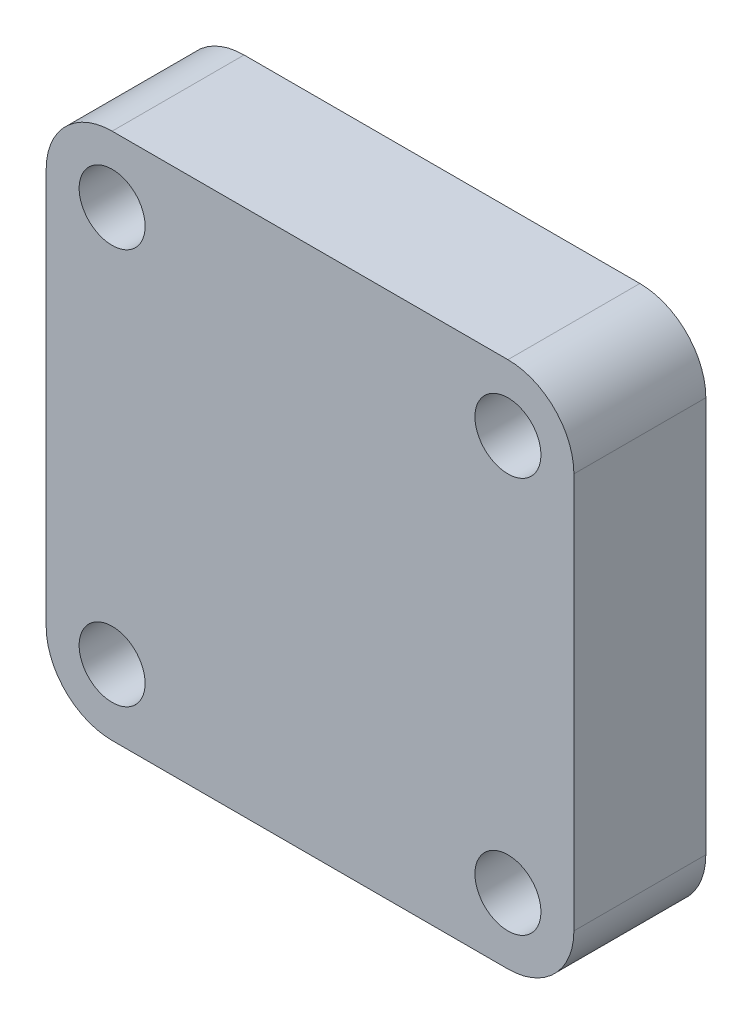
ISO-10303-21;
HEADER;
FILE_DESCRIPTION(('STEP AP214'),'2;1');
FILE_NAME('part.step','',(''),(''),'','','');
FILE_SCHEMA(('AUTOMOTIVE_DESIGN { 1 0 10303 214 1 1 1 1 }'));
ENDSEC;
DATA;
#1=APPLICATION_CONTEXT('core data for automotive mechanical design processes');
#2=APPLICATION_PROTOCOL_DEFINITION('international standard','automotive_design',2000,#1);
#3=PRODUCT_CONTEXT('',#1,'mechanical');
#4=PRODUCT('Part','Part','',(#3));
#5=PRODUCT_RELATED_PRODUCT_CATEGORY('part','',(#4));
#6=PRODUCT_DEFINITION_FORMATION('','',#4);
#7=PRODUCT_DEFINITION_CONTEXT('part definition',#1,'design');
#8=PRODUCT_DEFINITION('design','',#6,#7);
#9=PRODUCT_DEFINITION_SHAPE('','',#8);
#10=(LENGTH_UNIT() NAMED_UNIT(*) SI_UNIT(.MILLI.,.METRE.));
#11=(NAMED_UNIT(*) PLANE_ANGLE_UNIT() SI_UNIT($,.RADIAN.));
#12=(NAMED_UNIT(*) SI_UNIT($,.STERADIAN.) SOLID_ANGLE_UNIT());
#13=UNCERTAINTY_MEASURE_WITH_UNIT(LENGTH_MEASURE(1.E-05),#10,'distance_accuracy_value','');
#14=(GEOMETRIC_REPRESENTATION_CONTEXT(3) GLOBAL_UNCERTAINTY_ASSIGNED_CONTEXT((#13)) GLOBAL_UNIT_ASSIGNED_CONTEXT((#10,
#11,#12)) REPRESENTATION_CONTEXT('',''));
#15=CARTESIAN_POINT('',(0.,0.,0.));
#16=DIRECTION('',(0.,0.,1.));
#17=DIRECTION('',(1.,0.,0.));
#18=AXIS2_PLACEMENT_3D('',#15,#16,#17);
#19=CARTESIAN_POINT('',(0.,0.,10.));
#20=DIRECTION('',(1.,0.,0.));
#21=DIRECTION('',(0.,0.,-1.));
#22=AXIS2_PLACEMENT_3D('',#19,#20,#21);
#23=PLANE('',#22);
#24=DIRECTION('',(0.,-1.,0.));
#25=VECTOR('',#24,1.);
#26=CARTESIAN_POINT('',(0.,0.,0.));
#27=LINE('',#26,#25);
#28=CARTESIAN_POINT('',(0.,35.,0.));
#29=VERTEX_POINT('',#28);
#30=CARTESIAN_POINT('',(0.,5.,0.));
#31=VERTEX_POINT('',#30);
#32=EDGE_CURVE('E160',#29,#31,#27,.T.);
#33=ORIENTED_EDGE('',*,*,#32,.T.);
#34=DIRECTION('',(0.,0.,-1.));
#35=VECTOR('',#34,1.);
#36=CARTESIAN_POINT('',(0.,5.,10.));
#37=LINE('',#36,#35);
#38=CARTESIAN_POINT('',(0.,5.,10.));
#39=VERTEX_POINT('',#38);
#40=EDGE_CURVE('E11',#31,#39,#37,.F.);
#41=ORIENTED_EDGE('',*,*,#40,.T.);
#42=DIRECTION('',(0.,-1.,0.));
#43=VECTOR('',#42,1.);
#44=CARTESIAN_POINT('',(0.,0.,10.));
#45=LINE('',#44,#43);
#46=CARTESIAN_POINT('',(0.,35.,10.));
#47=VERTEX_POINT('',#46);
#48=EDGE_CURVE('E128',#47,#39,#45,.T.);
#49=ORIENTED_EDGE('',*,*,#48,.F.);
#50=DIRECTION('',(0.,0.,-1.));
#51=VECTOR('',#50,1.);
#52=CARTESIAN_POINT('',(0.,35.,10.));
#53=LINE('',#52,#51);
#54=EDGE_CURVE('E44',#47,#29,#53,.T.);
#55=ORIENTED_EDGE('',*,*,#54,.T.);
#56=EDGE_LOOP('',(#33,#41,#49,#55));
#57=FACE_BOUND('',#56,.T.);
#58=ADVANCED_FACE('F36',(#57),#23,.F.);
#59=CARTESIAN_POINT('',(0.,0.,10.));
#60=DIRECTION('',(0.,1.,0.));
#61=DIRECTION('',(0.,0.,1.));
#62=AXIS2_PLACEMENT_3D('',#59,#60,#61);
#63=PLANE('',#62);
#64=DIRECTION('',(1.,0.,0.));
#65=VECTOR('',#64,1.);
#66=CARTESIAN_POINT('',(0.,0.,0.));
#67=LINE('',#66,#65);
#68=CARTESIAN_POINT('',(5.,0.,0.));
#69=VERTEX_POINT('',#68);
#70=CARTESIAN_POINT('',(35.,0.,0.));
#71=VERTEX_POINT('',#70);
#72=EDGE_CURVE('E133',#69,#71,#67,.T.);
#73=ORIENTED_EDGE('',*,*,#72,.T.);
#74=DIRECTION('',(0.,0.,-1.));
#75=VECTOR('',#74,1.);
#76=CARTESIAN_POINT('',(35.,0.,10.));
#77=LINE('',#76,#75);
#78=CARTESIAN_POINT('',(35.,0.,10.));
#79=VERTEX_POINT('',#78);
#80=EDGE_CURVE('E51',#71,#79,#77,.F.);
#81=ORIENTED_EDGE('',*,*,#80,.T.);
#82=DIRECTION('',(1.,0.,0.));
#83=VECTOR('',#82,1.);
#84=CARTESIAN_POINT('',(0.,0.,10.));
#85=LINE('',#84,#83);
#86=CARTESIAN_POINT('',(5.,0.,10.));
#87=VERTEX_POINT('',#86);
#88=EDGE_CURVE('E131',#87,#79,#85,.T.);
#89=ORIENTED_EDGE('',*,*,#88,.F.);
#90=DIRECTION('',(0.,0.,-1.));
#91=VECTOR('',#90,1.);
#92=CARTESIAN_POINT('',(5.,0.,10.));
#93=LINE('',#92,#91);
#94=EDGE_CURVE('E152',#87,#69,#93,.T.);
#95=ORIENTED_EDGE('',*,*,#94,.T.);
#96=EDGE_LOOP('',(#73,#81,#89,#95));
#97=FACE_BOUND('',#96,.T.);
#98=ADVANCED_FACE('F222',(#97),#63,.F.);
#99=CARTESIAN_POINT('',(40.,0.,10.));
#100=DIRECTION('',(-1.,0.,0.));
#101=DIRECTION('',(0.,0.,1.));
#102=AXIS2_PLACEMENT_3D('',#99,#100,#101);
#103=PLANE('',#102);
#104=DIRECTION('',(0.,1.,0.));
#105=VECTOR('',#104,1.);
#106=CARTESIAN_POINT('',(40.,0.,0.));
#107=LINE('',#106,#105);
#108=CARTESIAN_POINT('',(40.,5.,0.));
#109=VERTEX_POINT('',#108);
#110=CARTESIAN_POINT('',(40.,35.,0.));
#111=VERTEX_POINT('',#110);
#112=EDGE_CURVE('E129',#109,#111,#107,.T.);
#113=ORIENTED_EDGE('',*,*,#112,.T.);
#114=DIRECTION('',(0.,0.,-1.));
#115=VECTOR('',#114,1.);
#116=CARTESIAN_POINT('',(40.,35.,10.));
#117=LINE('',#116,#115);
#118=CARTESIAN_POINT('',(40.,35.,10.));
#119=VERTEX_POINT('',#118);
#120=EDGE_CURVE('E107',#111,#119,#117,.F.);
#121=ORIENTED_EDGE('',*,*,#120,.T.);
#122=DIRECTION('',(0.,1.,0.));
#123=VECTOR('',#122,1.);
#124=CARTESIAN_POINT('',(40.,0.,10.));
#125=LINE('',#124,#123);
#126=CARTESIAN_POINT('',(40.,5.,10.));
#127=VERTEX_POINT('',#126);
#128=EDGE_CURVE('E172',#127,#119,#125,.T.);
#129=ORIENTED_EDGE('',*,*,#128,.F.);
#130=DIRECTION('',(0.,0.,-1.));
#131=VECTOR('',#130,1.);
#132=CARTESIAN_POINT('',(40.,5.,10.));
#133=LINE('',#132,#131);
#134=EDGE_CURVE('E112',#127,#109,#133,.T.);
#135=ORIENTED_EDGE('',*,*,#134,.T.);
#136=EDGE_LOOP('',(#113,#121,#129,#135));
#137=FACE_BOUND('',#136,.T.);
#138=ADVANCED_FACE('F219',(#137),#103,.F.);
#139=CARTESIAN_POINT('',(0.,40.,10.));
#140=DIRECTION('',(0.,-1.,0.));
#141=DIRECTION('',(0.,0.,-1.));
#142=AXIS2_PLACEMENT_3D('',#139,#140,#141);
#143=PLANE('',#142);
#144=DIRECTION('',(-1.,0.,0.));
#145=VECTOR('',#144,1.);
#146=CARTESIAN_POINT('',(0.,40.,10.));
#147=LINE('',#146,#145);
#148=CARTESIAN_POINT('',(35.,40.,10.));
#149=VERTEX_POINT('',#148);
#150=CARTESIAN_POINT('',(5.,40.,10.));
#151=VERTEX_POINT('',#150);
#152=EDGE_CURVE('E122',#149,#151,#147,.T.);
#153=ORIENTED_EDGE('',*,*,#152,.F.);
#154=DIRECTION('',(0.,0.,-1.));
#155=VECTOR('',#154,1.);
#156=CARTESIAN_POINT('',(35.,40.,10.));
#157=LINE('',#156,#155);
#158=CARTESIAN_POINT('',(35.,40.,0.));
#159=VERTEX_POINT('',#158);
#160=EDGE_CURVE('E106',#149,#159,#157,.T.);
#161=ORIENTED_EDGE('',*,*,#160,.T.);
#162=DIRECTION('',(-1.,0.,0.));
#163=VECTOR('',#162,1.);
#164=CARTESIAN_POINT('',(0.,40.,0.));
#165=LINE('',#164,#163);
#166=CARTESIAN_POINT('',(5.,40.,0.));
#167=VERTEX_POINT('',#166);
#168=EDGE_CURVE('E119',#159,#167,#165,.T.);
#169=ORIENTED_EDGE('',*,*,#168,.T.);
#170=DIRECTION('',(0.,0.,-1.));
#171=VECTOR('',#170,1.);
#172=CARTESIAN_POINT('',(5.,40.,10.));
#173=LINE('',#172,#171);
#174=EDGE_CURVE('E124',#167,#151,#173,.F.);
#175=ORIENTED_EDGE('',*,*,#174,.T.);
#176=EDGE_LOOP('',(#153,#161,#169,#175));
#177=FACE_BOUND('',#176,.T.);
#178=ADVANCED_FACE('F118',(#177),#143,.F.);
#179=CARTESIAN_POINT('',(0.,0.,10.));
#180=DIRECTION('',(0.,0.,-1.));
#181=DIRECTION('',(-1.,0.,0.));
#182=AXIS2_PLACEMENT_3D('',#179,#180,#181);
#183=PLANE('',#182);
#184=CARTESIAN_POINT('',(35.,5.,10.));
#185=DIRECTION('',(0.,0.,1.));
#186=DIRECTION('',(-1.,0.,0.));
#187=AXIS2_PLACEMENT_3D('',#184,#185,#186);
#188=CIRCLE('',#187,2.5);
#189=CARTESIAN_POINT('',(32.5,5.,10.));
#190=VERTEX_POINT('',#189);
#191=EDGE_CURVE('E191',#190,#190,#188,.T.);
#192=ORIENTED_EDGE('',*,*,#191,.F.);
#193=EDGE_LOOP('',(#192));
#194=FACE_BOUND('',#193,.T.);
#195=CARTESIAN_POINT('',(35.,35.,10.));
#196=DIRECTION('',(0.,0.,-1.));
#197=DIRECTION('',(-1.,0.,0.));
#198=AXIS2_PLACEMENT_3D('',#195,#196,#197);
#199=CIRCLE('',#198,2.5);
#200=CARTESIAN_POINT('',(32.5,35.,10.));
#201=VERTEX_POINT('',#200);
#202=EDGE_CURVE('E185',#201,#201,#199,.T.);
#203=ORIENTED_EDGE('',*,*,#202,.T.);
#204=EDGE_LOOP('',(#203));
#205=FACE_BOUND('',#204,.T.);
#206=CARTESIAN_POINT('',(5.,5.,10.));
#207=DIRECTION('',(0.,0.,-1.));
#208=DIRECTION('',(1.,0.,0.));
#209=AXIS2_PLACEMENT_3D('',#206,#207,#208);
#210=CIRCLE('',#209,2.5);
#211=CARTESIAN_POINT('',(7.5,5.,10.));
#212=VERTEX_POINT('',#211);
#213=EDGE_CURVE('E179',#212,#212,#210,.T.);
#214=ORIENTED_EDGE('',*,*,#213,.T.);
#215=EDGE_LOOP('',(#214));
#216=FACE_BOUND('',#215,.T.);
#217=CARTESIAN_POINT('',(5.,35.,10.));
#218=DIRECTION('',(0.,0.,1.));
#219=DIRECTION('',(1.,0.,0.));
#220=AXIS2_PLACEMENT_3D('',#217,#218,#219);
#221=CIRCLE('',#220,2.5);
#222=CARTESIAN_POINT('',(7.5,35.,10.));
#223=VERTEX_POINT('',#222);
#224=EDGE_CURVE('E168',#223,#223,#221,.T.);
#225=ORIENTED_EDGE('',*,*,#224,.F.);
#226=EDGE_LOOP('',(#225));
#227=FACE_BOUND('',#226,.T.);
#228=ORIENTED_EDGE('',*,*,#128,.T.);
#229=CARTESIAN_POINT('',(35.,35.,10.));
#230=DIRECTION('',(0.,0.,-1.));
#231=DIRECTION('',(-1.,0.,0.));
#232=AXIS2_PLACEMENT_3D('',#229,#230,#231);
#233=CIRCLE('',#232,5.);
#234=EDGE_CURVE('E150',#119,#149,#233,.F.);
#235=ORIENTED_EDGE('',*,*,#234,.T.);
#236=ORIENTED_EDGE('',*,*,#152,.T.);
#237=CARTESIAN_POINT('',(5.,35.,10.));
#238=DIRECTION('',(0.,0.,-1.));
#239=DIRECTION('',(-1.,0.,0.));
#240=AXIS2_PLACEMENT_3D('',#237,#238,#239);
#241=CIRCLE('',#240,5.);
#242=EDGE_CURVE('E145',#151,#47,#241,.F.);
#243=ORIENTED_EDGE('',*,*,#242,.T.);
#244=ORIENTED_EDGE('',*,*,#48,.T.);
#245=CARTESIAN_POINT('',(5.,5.,10.));
#246=DIRECTION('',(0.,0.,-1.));
#247=DIRECTION('',(-1.,0.,0.));
#248=AXIS2_PLACEMENT_3D('',#245,#246,#247);
#249=CIRCLE('',#248,5.);
#250=EDGE_CURVE('E58',#39,#87,#249,.F.);
#251=ORIENTED_EDGE('',*,*,#250,.T.);
#252=ORIENTED_EDGE('',*,*,#88,.T.);
#253=CARTESIAN_POINT('',(35.,5.,10.));
#254=DIRECTION('',(0.,0.,-1.));
#255=DIRECTION('',(-1.,0.,0.));
#256=AXIS2_PLACEMENT_3D('',#253,#254,#255);
#257=CIRCLE('',#256,5.);
#258=EDGE_CURVE('E148',#79,#127,#257,.F.);
#259=ORIENTED_EDGE('',*,*,#258,.T.);
#260=EDGE_LOOP('',(#228,#235,#236,#243,#244,#251,#252,#259));
#261=FACE_BOUND('',#260,.T.);
#262=ADVANCED_FACE('F206',(#194,#205,#216,#227,#261),#183,.F.);
#263=CARTESIAN_POINT('',(0.,0.,0.));
#264=DIRECTION('',(0.,0.,-1.));
#265=DIRECTION('',(-1.,0.,0.));
#266=AXIS2_PLACEMENT_3D('',#263,#264,#265);
#267=PLANE('',#266);
#268=CARTESIAN_POINT('',(35.,5.,0.));
#269=DIRECTION('',(0.,0.,1.));
#270=DIRECTION('',(-1.,0.,0.));
#271=AXIS2_PLACEMENT_3D('',#268,#269,#270);
#272=CIRCLE('',#271,2.5);
#273=CARTESIAN_POINT('',(32.5,5.,0.));
#274=VERTEX_POINT('',#273);
#275=EDGE_CURVE('E188',#274,#274,#272,.T.);
#276=ORIENTED_EDGE('',*,*,#275,.T.);
#277=EDGE_LOOP('',(#276));
#278=FACE_BOUND('',#277,.T.);
#279=CARTESIAN_POINT('',(35.,35.,0.));
#280=DIRECTION('',(0.,0.,-1.));
#281=DIRECTION('',(-1.,0.,0.));
#282=AXIS2_PLACEMENT_3D('',#279,#280,#281);
#283=CIRCLE('',#282,2.5);
#284=CARTESIAN_POINT('',(32.5,35.,0.));
#285=VERTEX_POINT('',#284);
#286=EDGE_CURVE('E182',#285,#285,#283,.T.);
#287=ORIENTED_EDGE('',*,*,#286,.F.);
#288=EDGE_LOOP('',(#287));
#289=FACE_BOUND('',#288,.T.);
#290=CARTESIAN_POINT('',(5.,5.,0.));
#291=DIRECTION('',(0.,0.,-1.));
#292=DIRECTION('',(1.,0.,0.));
#293=AXIS2_PLACEMENT_3D('',#290,#291,#292);
#294=CIRCLE('',#293,2.5);
#295=CARTESIAN_POINT('',(7.5,5.,0.));
#296=VERTEX_POINT('',#295);
#297=EDGE_CURVE('E177',#296,#296,#294,.T.);
#298=ORIENTED_EDGE('',*,*,#297,.F.);
#299=EDGE_LOOP('',(#298));
#300=FACE_BOUND('',#299,.T.);
#301=CARTESIAN_POINT('',(5.,35.,0.));
#302=DIRECTION('',(0.,0.,1.));
#303=DIRECTION('',(1.,0.,0.));
#304=AXIS2_PLACEMENT_3D('',#301,#302,#303);
#305=CIRCLE('',#304,2.5);
#306=CARTESIAN_POINT('',(7.5,35.,0.));
#307=VERTEX_POINT('',#306);
#308=EDGE_CURVE('E165',#307,#307,#305,.T.);
#309=ORIENTED_EDGE('',*,*,#308,.T.);
#310=EDGE_LOOP('',(#309));
#311=FACE_BOUND('',#310,.T.);
#312=ORIENTED_EDGE('',*,*,#168,.F.);
#313=CARTESIAN_POINT('',(35.,35.,0.));
#314=DIRECTION('',(0.,0.,-1.));
#315=DIRECTION('',(-1.,0.,0.));
#316=AXIS2_PLACEMENT_3D('',#313,#314,#315);
#317=CIRCLE('',#316,5.);
#318=EDGE_CURVE('E102',#159,#111,#317,.T.);
#319=ORIENTED_EDGE('',*,*,#318,.T.);
#320=ORIENTED_EDGE('',*,*,#112,.F.);
#321=CARTESIAN_POINT('',(35.,5.,0.));
#322=DIRECTION('',(0.,0.,-1.));
#323=DIRECTION('',(-1.,0.,0.));
#324=AXIS2_PLACEMENT_3D('',#321,#322,#323);
#325=CIRCLE('',#324,5.);
#326=EDGE_CURVE('E113',#109,#71,#325,.T.);
#327=ORIENTED_EDGE('',*,*,#326,.T.);
#328=ORIENTED_EDGE('',*,*,#72,.F.);
#329=CARTESIAN_POINT('',(5.,5.,0.));
#330=DIRECTION('',(0.,0.,-1.));
#331=DIRECTION('',(-1.,0.,0.));
#332=AXIS2_PLACEMENT_3D('',#329,#330,#331);
#333=CIRCLE('',#332,5.);
#334=EDGE_CURVE('E139',#69,#31,#333,.T.);
#335=ORIENTED_EDGE('',*,*,#334,.T.);
#336=ORIENTED_EDGE('',*,*,#32,.F.);
#337=CARTESIAN_POINT('',(5.,35.,0.));
#338=DIRECTION('',(0.,0.,-1.));
#339=DIRECTION('',(-1.,0.,0.));
#340=AXIS2_PLACEMENT_3D('',#337,#338,#339);
#341=CIRCLE('',#340,5.);
#342=EDGE_CURVE('E123',#29,#167,#341,.T.);
#343=ORIENTED_EDGE('',*,*,#342,.T.);
#344=EDGE_LOOP('',(#312,#319,#320,#327,#328,#335,#336,#343));
#345=FACE_BOUND('',#344,.T.);
#346=ADVANCED_FACE('F126',(#278,#289,#300,#311,#345),#267,.T.);
#347=CARTESIAN_POINT('',(5.,35.,0.));
#348=DIRECTION('',(0.,0.,1.));
#349=DIRECTION('',(1.,0.,0.));
#350=AXIS2_PLACEMENT_3D('',#347,#348,#349);
#351=CYLINDRICAL_SURFACE('',#350,2.5);
#352=ORIENTED_EDGE('',*,*,#308,.F.);
#353=EDGE_LOOP('',(#352));
#354=FACE_BOUND('',#353,.T.);
#355=ORIENTED_EDGE('',*,*,#224,.T.);
#356=EDGE_LOOP('',(#355));
#357=FACE_BOUND('',#356,.T.);
#358=ADVANCED_FACE('F284',(#354,#357),#351,.F.);
#359=CARTESIAN_POINT('',(5.,5.,0.));
#360=DIRECTION('',(0.,0.,1.));
#361=DIRECTION('',(1.,0.,0.));
#362=AXIS2_PLACEMENT_3D('',#359,#360,#361);
#363=CYLINDRICAL_SURFACE('',#362,2.5);
#364=ORIENTED_EDGE('',*,*,#297,.T.);
#365=EDGE_LOOP('',(#364));
#366=FACE_BOUND('',#365,.T.);
#367=ORIENTED_EDGE('',*,*,#213,.F.);
#368=EDGE_LOOP('',(#367));
#369=FACE_BOUND('',#368,.T.);
#370=ADVANCED_FACE('F275',(#366,#369),#363,.F.);
#371=CARTESIAN_POINT('',(35.,35.,0.));
#372=DIRECTION('',(0.,0.,1.));
#373=DIRECTION('',(1.,0.,0.));
#374=AXIS2_PLACEMENT_3D('',#371,#372,#373);
#375=CYLINDRICAL_SURFACE('',#374,2.5);
#376=ORIENTED_EDGE('',*,*,#286,.T.);
#377=EDGE_LOOP('',(#376));
#378=FACE_BOUND('',#377,.T.);
#379=ORIENTED_EDGE('',*,*,#202,.F.);
#380=EDGE_LOOP('',(#379));
#381=FACE_BOUND('',#380,.T.);
#382=ADVANCED_FACE('F202',(#378,#381),#375,.F.);
#383=CARTESIAN_POINT('',(35.,5.,0.));
#384=DIRECTION('',(0.,0.,1.));
#385=DIRECTION('',(1.,0.,0.));
#386=AXIS2_PLACEMENT_3D('',#383,#384,#385);
#387=CYLINDRICAL_SURFACE('',#386,2.5);
#388=ORIENTED_EDGE('',*,*,#275,.F.);
#389=EDGE_LOOP('',(#388));
#390=FACE_BOUND('',#389,.T.);
#391=ORIENTED_EDGE('',*,*,#191,.T.);
#392=EDGE_LOOP('',(#391));
#393=FACE_BOUND('',#392,.T.);
#394=ADVANCED_FACE('F199',(#390,#393),#387,.F.);
#395=CARTESIAN_POINT('',(35.,35.,10.));
#396=DIRECTION('',(0.,0.,-1.));
#397=DIRECTION('',(-1.,0.,0.));
#398=AXIS2_PLACEMENT_3D('',#395,#396,#397);
#399=CYLINDRICAL_SURFACE('',#398,5.);
#400=ORIENTED_EDGE('',*,*,#234,.F.);
#401=ORIENTED_EDGE('',*,*,#120,.F.);
#402=ORIENTED_EDGE('',*,*,#318,.F.);
#403=ORIENTED_EDGE('',*,*,#160,.F.);
#404=EDGE_LOOP('',(#400,#401,#402,#403));
#405=FACE_BOUND('',#404,.T.);
#406=ADVANCED_FACE('F105',(#405),#399,.T.);
#407=CARTESIAN_POINT('',(35.,5.,10.));
#408=DIRECTION('',(0.,0.,-1.));
#409=DIRECTION('',(-1.,0.,0.));
#410=AXIS2_PLACEMENT_3D('',#407,#408,#409);
#411=CYLINDRICAL_SURFACE('',#410,5.);
#412=ORIENTED_EDGE('',*,*,#258,.F.);
#413=ORIENTED_EDGE('',*,*,#80,.F.);
#414=ORIENTED_EDGE('',*,*,#326,.F.);
#415=ORIENTED_EDGE('',*,*,#134,.F.);
#416=EDGE_LOOP('',(#412,#413,#414,#415));
#417=FACE_BOUND('',#416,.T.);
#418=ADVANCED_FACE('F221',(#417),#411,.T.);
#419=CARTESIAN_POINT('',(5.,5.,10.));
#420=DIRECTION('',(0.,0.,-1.));
#421=DIRECTION('',(-1.,0.,0.));
#422=AXIS2_PLACEMENT_3D('',#419,#420,#421);
#423=CYLINDRICAL_SURFACE('',#422,5.);
#424=ORIENTED_EDGE('',*,*,#250,.F.);
#425=ORIENTED_EDGE('',*,*,#40,.F.);
#426=ORIENTED_EDGE('',*,*,#334,.F.);
#427=ORIENTED_EDGE('',*,*,#94,.F.);
#428=EDGE_LOOP('',(#424,#425,#426,#427));
#429=FACE_BOUND('',#428,.T.);
#430=ADVANCED_FACE('F225',(#429),#423,.T.);
#431=CARTESIAN_POINT('',(5.,35.,10.));
#432=DIRECTION('',(0.,0.,-1.));
#433=DIRECTION('',(-1.,0.,0.));
#434=AXIS2_PLACEMENT_3D('',#431,#432,#433);
#435=CYLINDRICAL_SURFACE('',#434,5.);
#436=ORIENTED_EDGE('',*,*,#242,.F.);
#437=ORIENTED_EDGE('',*,*,#174,.F.);
#438=ORIENTED_EDGE('',*,*,#342,.F.);
#439=ORIENTED_EDGE('',*,*,#54,.F.);
#440=EDGE_LOOP('',(#436,#437,#438,#439));
#441=FACE_BOUND('',#440,.T.);
#442=ADVANCED_FACE('F38',(#441),#435,.T.);
#443=CLOSED_SHELL('',(#58,#98,#138,#178,#262,#346,#358,#370,#382,#394,#406,#418,#430,#442));
#444=MANIFOLD_SOLID_BREP('B2',#443);
#445=ADVANCED_BREP_SHAPE_REPRESENTATION('',(#18,#444),#14);
#446=SHAPE_DEFINITION_REPRESENTATION(#9,#445);
ENDSEC;
END-ISO-10303-21;
